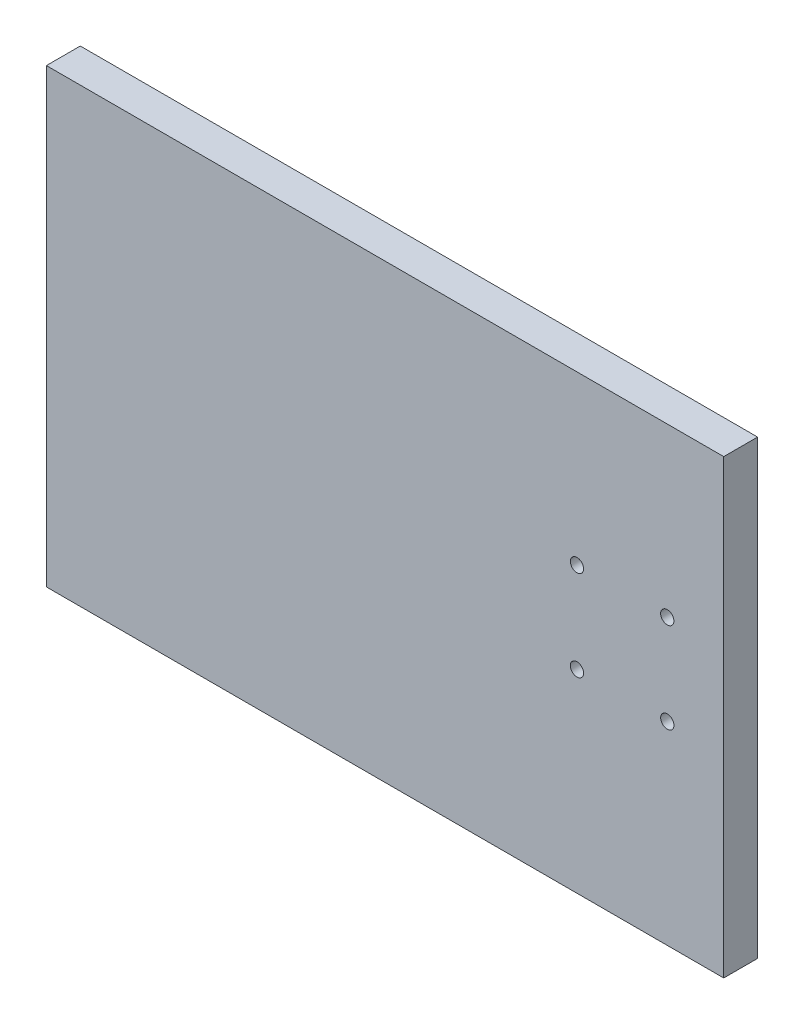
ISO-10303-21;
HEADER;
FILE_DESCRIPTION(('STEP AP214'),'2;1');
FILE_NAME('part.step','',(''),(''),'','','');
FILE_SCHEMA(('AUTOMOTIVE_DESIGN { 1 0 10303 214 1 1 1 1 }'));
ENDSEC;
DATA;
#1=APPLICATION_CONTEXT('core data for automotive mechanical design processes');
#2=APPLICATION_PROTOCOL_DEFINITION('international standard','automotive_design',2000,#1);
#3=PRODUCT_CONTEXT('',#1,'mechanical');
#4=PRODUCT('Part','Part','',(#3));
#5=PRODUCT_RELATED_PRODUCT_CATEGORY('part','',(#4));
#6=PRODUCT_DEFINITION_FORMATION('','',#4);
#7=PRODUCT_DEFINITION_CONTEXT('part definition',#1,'design');
#8=PRODUCT_DEFINITION('design','',#6,#7);
#9=PRODUCT_DEFINITION_SHAPE('','',#8);
#10=(LENGTH_UNIT() NAMED_UNIT(*) SI_UNIT(.MILLI.,.METRE.));
#11=(NAMED_UNIT(*) PLANE_ANGLE_UNIT() SI_UNIT($,.RADIAN.));
#12=(NAMED_UNIT(*) SI_UNIT($,.STERADIAN.) SOLID_ANGLE_UNIT());
#13=UNCERTAINTY_MEASURE_WITH_UNIT(LENGTH_MEASURE(1.E-05),#10,'distance_accuracy_value','');
#14=(GEOMETRIC_REPRESENTATION_CONTEXT(3) GLOBAL_UNCERTAINTY_ASSIGNED_CONTEXT((#13)) GLOBAL_UNIT_ASSIGNED_CONTEXT((#10,
#11,#12)) REPRESENTATION_CONTEXT('',''));
#15=CARTESIAN_POINT('',(0.,0.,0.));
#16=DIRECTION('',(0.,0.,1.));
#17=DIRECTION('',(1.,0.,0.));
#18=AXIS2_PLACEMENT_3D('',#15,#16,#17);
#19=CARTESIAN_POINT('',(-64.0158720642566,42.1858972249347,6.));
#20=DIRECTION('',(1.,0.,0.));
#21=DIRECTION('',(0.,0.,-1.));
#22=AXIS2_PLACEMENT_3D('',#19,#20,#21);
#23=PLANE('',#22);
#24=DIRECTION('',(0.,-1.,0.));
#25=VECTOR('',#24,1.);
#26=CARTESIAN_POINT('',(-64.0158720642566,42.1858972249347,0.));
#27=LINE('',#26,#25);
#28=CARTESIAN_POINT('',(-64.0158720642566,42.1858972249347,0.));
#29=VERTEX_POINT('',#28);
#30=CARTESIAN_POINT('',(-64.0158720642566,-37.8141027750654,0.));
#31=VERTEX_POINT('',#30);
#32=EDGE_CURVE('E96',#29,#31,#27,.T.);
#33=ORIENTED_EDGE('',*,*,#32,.T.);
#34=DIRECTION('',(0.,0.,-1.));
#35=VECTOR('',#34,1.);
#36=CARTESIAN_POINT('',(-64.0158720642566,-37.8141027750654,6.));
#37=LINE('',#36,#35);
#38=CARTESIAN_POINT('',(-64.0158720642566,-37.8141027750654,6.));
#39=VERTEX_POINT('',#38);
#40=EDGE_CURVE('E11',#39,#31,#37,.T.);
#41=ORIENTED_EDGE('',*,*,#40,.F.);
#42=DIRECTION('',(0.,-1.,0.));
#43=VECTOR('',#42,1.);
#44=CARTESIAN_POINT('',(-64.0158720642566,42.1858972249347,6.));
#45=LINE('',#44,#43);
#46=CARTESIAN_POINT('',(-64.0158720642566,42.1858972249347,6.));
#47=VERTEX_POINT('',#46);
#48=EDGE_CURVE('E84',#47,#39,#45,.T.);
#49=ORIENTED_EDGE('',*,*,#48,.F.);
#50=DIRECTION('',(0.,0.,-1.));
#51=VECTOR('',#50,1.);
#52=CARTESIAN_POINT('',(-64.0158720642566,42.1858972249347,6.));
#53=LINE('',#52,#51);
#54=EDGE_CURVE('E92',#47,#29,#53,.T.);
#55=ORIENTED_EDGE('',*,*,#54,.T.);
#56=EDGE_LOOP('',(#33,#41,#49,#55));
#57=FACE_BOUND('',#56,.T.);
#58=ADVANCED_FACE('F33',(#57),#23,.F.);
#59=CARTESIAN_POINT('',(-64.0158720642566,-37.8141027750654,6.));
#60=DIRECTION('',(0.,1.,0.));
#61=DIRECTION('',(-1.,0.,0.));
#62=AXIS2_PLACEMENT_3D('',#59,#60,#61);
#63=PLANE('',#62);
#64=DIRECTION('',(1.,0.,0.));
#65=VECTOR('',#64,1.);
#66=CARTESIAN_POINT('',(-64.0158720642566,-37.8141027750654,0.));
#67=LINE('',#66,#65);
#68=CARTESIAN_POINT('',(55.9841279357434,-37.8141027750653,0.));
#69=VERTEX_POINT('',#68);
#70=EDGE_CURVE('E88',#31,#69,#67,.T.);
#71=ORIENTED_EDGE('',*,*,#70,.T.);
#72=DIRECTION('',(0.,0.,-1.));
#73=VECTOR('',#72,1.);
#74=CARTESIAN_POINT('',(55.9841279357434,-37.8141027750653,6.));
#75=LINE('',#74,#73);
#76=CARTESIAN_POINT('',(55.9841279357434,-37.8141027750653,6.));
#77=VERTEX_POINT('',#76);
#78=EDGE_CURVE('E41',#77,#69,#75,.T.);
#79=ORIENTED_EDGE('',*,*,#78,.F.);
#80=DIRECTION('',(1.,0.,0.));
#81=VECTOR('',#80,1.);
#82=CARTESIAN_POINT('',(-64.0158720642566,-37.8141027750654,6.));
#83=LINE('',#82,#81);
#84=EDGE_CURVE('E79',#39,#77,#83,.T.);
#85=ORIENTED_EDGE('',*,*,#84,.F.);
#86=ORIENTED_EDGE('',*,*,#40,.T.);
#87=EDGE_LOOP('',(#71,#79,#85,#86));
#88=FACE_BOUND('',#87,.T.);
#89=ADVANCED_FACE('F87',(#88),#63,.F.);
#90=CARTESIAN_POINT('',(55.9841279357434,42.1858972249347,6.));
#91=DIRECTION('',(-1.,0.,0.));
#92=DIRECTION('',(0.,-1.,0.));
#93=AXIS2_PLACEMENT_3D('',#90,#91,#92);
#94=PLANE('',#93);
#95=DIRECTION('',(0.,1.,0.));
#96=VECTOR('',#95,1.);
#97=CARTESIAN_POINT('',(55.9841279357434,42.1858972249347,0.));
#98=LINE('',#97,#96);
#99=CARTESIAN_POINT('',(55.9841279357434,42.1858972249347,0.));
#100=VERTEX_POINT('',#99);
#101=EDGE_CURVE('E66',#69,#100,#98,.T.);
#102=ORIENTED_EDGE('',*,*,#101,.T.);
#103=DIRECTION('',(0.,0.,-1.));
#104=VECTOR('',#103,1.);
#105=CARTESIAN_POINT('',(55.9841279357434,42.1858972249347,6.));
#106=LINE('',#105,#104);
#107=CARTESIAN_POINT('',(55.9841279357434,42.1858972249347,6.));
#108=VERTEX_POINT('',#107);
#109=EDGE_CURVE('E89',#108,#100,#106,.T.);
#110=ORIENTED_EDGE('',*,*,#109,.F.);
#111=DIRECTION('',(0.,1.,0.));
#112=VECTOR('',#111,1.);
#113=CARTESIAN_POINT('',(55.9841279357434,42.1858972249347,6.));
#114=LINE('',#113,#112);
#115=EDGE_CURVE('E82',#77,#108,#114,.T.);
#116=ORIENTED_EDGE('',*,*,#115,.F.);
#117=ORIENTED_EDGE('',*,*,#78,.T.);
#118=EDGE_LOOP('',(#102,#110,#116,#117));
#119=FACE_BOUND('',#118,.T.);
#120=ADVANCED_FACE('F90',(#119),#94,.F.);
#121=CARTESIAN_POINT('',(-64.0158720642566,42.1858972249347,6.));
#122=DIRECTION('',(0.,-1.,0.));
#123=DIRECTION('',(0.,0.,-1.));
#124=AXIS2_PLACEMENT_3D('',#121,#122,#123);
#125=PLANE('',#124);
#126=DIRECTION('',(-1.,0.,0.));
#127=VECTOR('',#126,1.);
#128=CARTESIAN_POINT('',(-64.0158720642566,42.1858972249347,0.));
#129=LINE('',#128,#127);
#130=EDGE_CURVE('E72',#100,#29,#129,.T.);
#131=ORIENTED_EDGE('',*,*,#130,.T.);
#132=ORIENTED_EDGE('',*,*,#54,.F.);
#133=DIRECTION('',(-1.,0.,0.));
#134=VECTOR('',#133,1.);
#135=CARTESIAN_POINT('',(-64.0158720642566,42.1858972249347,6.));
#136=LINE('',#135,#134);
#137=EDGE_CURVE('E49',#108,#47,#136,.T.);
#138=ORIENTED_EDGE('',*,*,#137,.F.);
#139=ORIENTED_EDGE('',*,*,#109,.T.);
#140=EDGE_LOOP('',(#131,#132,#138,#139));
#141=FACE_BOUND('',#140,.T.);
#142=ADVANCED_FACE('F104',(#141),#125,.F.);
#143=CARTESIAN_POINT('',(0.,0.,6.));
#144=DIRECTION('',(0.,0.,1.));
#145=DIRECTION('',(1.,0.,0.));
#146=AXIS2_PLACEMENT_3D('',#143,#144,#145);
#147=PLANE('',#146);
#148=CARTESIAN_POINT('',(45.9841279357434,-3.46410277506529,6.));
#149=DIRECTION('',(0.,0.,1.));
#150=DIRECTION('',(1.,0.,0.));
#151=AXIS2_PLACEMENT_3D('',#148,#149,#150);
#152=CIRCLE('',#151,1.175);
#153=CARTESIAN_POINT('',(47.1591279357434,-3.46410277506529,6.));
#154=VERTEX_POINT('',#153);
#155=EDGE_CURVE('E128',#154,#154,#152,.T.);
#156=ORIENTED_EDGE('',*,*,#155,.F.);
#157=EDGE_LOOP('',(#156));
#158=FACE_BOUND('',#157,.T.);
#159=CARTESIAN_POINT('',(29.9841279357434,-3.46410277506529,6.));
#160=DIRECTION('',(0.,0.,1.));
#161=DIRECTION('',(1.,0.,0.));
#162=AXIS2_PLACEMENT_3D('',#159,#160,#161);
#163=CIRCLE('',#162,1.17499999999999);
#164=CARTESIAN_POINT('',(31.1591279357434,-3.46410277506529,6.));
#165=VERTEX_POINT('',#164);
#166=EDGE_CURVE('E122',#165,#165,#163,.T.);
#167=ORIENTED_EDGE('',*,*,#166,.F.);
#168=EDGE_LOOP('',(#167));
#169=FACE_BOUND('',#168,.T.);
#170=CARTESIAN_POINT('',(29.9841279357434,12.5358972249347,6.));
#171=DIRECTION('',(0.,0.,1.));
#172=DIRECTION('',(1.,0.,0.));
#173=AXIS2_PLACEMENT_3D('',#170,#171,#172);
#174=CIRCLE('',#173,1.17499999999999);
#175=CARTESIAN_POINT('',(31.1591279357434,12.5358972249347,6.));
#176=VERTEX_POINT('',#175);
#177=EDGE_CURVE('E116',#176,#176,#174,.T.);
#178=ORIENTED_EDGE('',*,*,#177,.F.);
#179=EDGE_LOOP('',(#178));
#180=FACE_BOUND('',#179,.T.);
#181=CARTESIAN_POINT('',(45.9841279357434,12.5358972249347,6.));
#182=DIRECTION('',(0.,0.,1.));
#183=DIRECTION('',(1.,0.,0.));
#184=AXIS2_PLACEMENT_3D('',#181,#182,#183);
#185=CIRCLE('',#184,1.175);
#186=CARTESIAN_POINT('',(47.1591279357434,12.5358972249347,6.));
#187=VERTEX_POINT('',#186);
#188=EDGE_CURVE('E110',#187,#187,#185,.T.);
#189=ORIENTED_EDGE('',*,*,#188,.F.);
#190=EDGE_LOOP('',(#189));
#191=FACE_BOUND('',#190,.T.);
#192=ORIENTED_EDGE('',*,*,#48,.T.);
#193=ORIENTED_EDGE('',*,*,#84,.T.);
#194=ORIENTED_EDGE('',*,*,#115,.T.);
#195=ORIENTED_EDGE('',*,*,#137,.T.);
#196=EDGE_LOOP('',(#192,#193,#194,#195));
#197=FACE_BOUND('',#196,.T.);
#198=ADVANCED_FACE('F80',(#158,#169,#180,#191,#197),#147,.T.);
#199=CARTESIAN_POINT('',(0.,0.,0.));
#200=DIRECTION('',(0.,0.,1.));
#201=DIRECTION('',(1.,0.,0.));
#202=AXIS2_PLACEMENT_3D('',#199,#200,#201);
#203=PLANE('',#202);
#204=CARTESIAN_POINT('',(45.9841279357434,-3.46410277506529,0.));
#205=DIRECTION('',(0.,0.,1.));
#206=DIRECTION('',(1.,0.,0.));
#207=AXIS2_PLACEMENT_3D('',#204,#205,#206);
#208=CIRCLE('',#207,1.175);
#209=CARTESIAN_POINT('',(47.1591279357434,-3.46410277506529,0.));
#210=VERTEX_POINT('',#209);
#211=EDGE_CURVE('E125',#210,#210,#208,.T.);
#212=ORIENTED_EDGE('',*,*,#211,.T.);
#213=EDGE_LOOP('',(#212));
#214=FACE_BOUND('',#213,.T.);
#215=CARTESIAN_POINT('',(29.9841279357434,-3.46410277506529,0.));
#216=DIRECTION('',(0.,0.,1.));
#217=DIRECTION('',(1.,0.,0.));
#218=AXIS2_PLACEMENT_3D('',#215,#216,#217);
#219=CIRCLE('',#218,1.17499999999999);
#220=CARTESIAN_POINT('',(31.1591279357434,-3.46410277506529,0.));
#221=VERTEX_POINT('',#220);
#222=EDGE_CURVE('E119',#221,#221,#219,.T.);
#223=ORIENTED_EDGE('',*,*,#222,.T.);
#224=EDGE_LOOP('',(#223));
#225=FACE_BOUND('',#224,.T.);
#226=CARTESIAN_POINT('',(29.9841279357434,12.5358972249347,0.));
#227=DIRECTION('',(0.,0.,1.));
#228=DIRECTION('',(1.,0.,0.));
#229=AXIS2_PLACEMENT_3D('',#226,#227,#228);
#230=CIRCLE('',#229,1.17499999999999);
#231=CARTESIAN_POINT('',(31.1591279357434,12.5358972249347,0.));
#232=VERTEX_POINT('',#231);
#233=EDGE_CURVE('E113',#232,#232,#230,.T.);
#234=ORIENTED_EDGE('',*,*,#233,.T.);
#235=EDGE_LOOP('',(#234));
#236=FACE_BOUND('',#235,.T.);
#237=CARTESIAN_POINT('',(45.9841279357434,12.5358972249347,0.));
#238=DIRECTION('',(0.,0.,1.));
#239=DIRECTION('',(1.,0.,0.));
#240=AXIS2_PLACEMENT_3D('',#237,#238,#239);
#241=CIRCLE('',#240,1.175);
#242=CARTESIAN_POINT('',(47.1591279357434,12.5358972249347,0.));
#243=VERTEX_POINT('',#242);
#244=EDGE_CURVE('E99',#243,#243,#241,.T.);
#245=ORIENTED_EDGE('',*,*,#244,.T.);
#246=EDGE_LOOP('',(#245));
#247=FACE_BOUND('',#246,.T.);
#248=ORIENTED_EDGE('',*,*,#32,.F.);
#249=ORIENTED_EDGE('',*,*,#130,.F.);
#250=ORIENTED_EDGE('',*,*,#101,.F.);
#251=ORIENTED_EDGE('',*,*,#70,.F.);
#252=EDGE_LOOP('',(#248,#249,#250,#251));
#253=FACE_BOUND('',#252,.T.);
#254=ADVANCED_FACE('F107',(#214,#225,#236,#247,#253),#203,.F.);
#255=CARTESIAN_POINT('',(45.9841279357434,12.5358972249347,0.));
#256=DIRECTION('',(0.,0.,1.));
#257=DIRECTION('',(1.,0.,0.));
#258=AXIS2_PLACEMENT_3D('',#255,#256,#257);
#259=CYLINDRICAL_SURFACE('',#258,1.175);
#260=ORIENTED_EDGE('',*,*,#244,.F.);
#261=EDGE_LOOP('',(#260));
#262=FACE_BOUND('',#261,.T.);
#263=ORIENTED_EDGE('',*,*,#188,.T.);
#264=EDGE_LOOP('',(#263));
#265=FACE_BOUND('',#264,.T.);
#266=ADVANCED_FACE('F152',(#262,#265),#259,.F.);
#267=CARTESIAN_POINT('',(29.9841279357434,12.5358972249347,0.));
#268=DIRECTION('',(0.,0.,1.));
#269=DIRECTION('',(1.,0.,0.));
#270=AXIS2_PLACEMENT_3D('',#267,#268,#269);
#271=CYLINDRICAL_SURFACE('',#270,1.17499999999999);
#272=ORIENTED_EDGE('',*,*,#233,.F.);
#273=EDGE_LOOP('',(#272));
#274=FACE_BOUND('',#273,.T.);
#275=ORIENTED_EDGE('',*,*,#177,.T.);
#276=EDGE_LOOP('',(#275));
#277=FACE_BOUND('',#276,.T.);
#278=ADVANCED_FACE('F154',(#274,#277),#271,.F.);
#279=CARTESIAN_POINT('',(29.9841279357434,-3.46410277506529,0.));
#280=DIRECTION('',(0.,0.,1.));
#281=DIRECTION('',(1.,0.,0.));
#282=AXIS2_PLACEMENT_3D('',#279,#280,#281);
#283=CYLINDRICAL_SURFACE('',#282,1.17499999999999);
#284=ORIENTED_EDGE('',*,*,#222,.F.);
#285=EDGE_LOOP('',(#284));
#286=FACE_BOUND('',#285,.T.);
#287=ORIENTED_EDGE('',*,*,#166,.T.);
#288=EDGE_LOOP('',(#287));
#289=FACE_BOUND('',#288,.T.);
#290=ADVANCED_FACE('F139',(#286,#289),#283,.F.);
#291=CARTESIAN_POINT('',(45.9841279357434,-3.46410277506529,0.));
#292=DIRECTION('',(0.,0.,1.));
#293=DIRECTION('',(1.,0.,0.));
#294=AXIS2_PLACEMENT_3D('',#291,#292,#293);
#295=CYLINDRICAL_SURFACE('',#294,1.175);
#296=ORIENTED_EDGE('',*,*,#211,.F.);
#297=EDGE_LOOP('',(#296));
#298=FACE_BOUND('',#297,.T.);
#299=ORIENTED_EDGE('',*,*,#155,.T.);
#300=EDGE_LOOP('',(#299));
#301=FACE_BOUND('',#300,.T.);
#302=ADVANCED_FACE('F136',(#298,#301),#295,.F.);
#303=CLOSED_SHELL('',(#58,#89,#120,#142,#198,#254,#266,#278,#290,#302));
#304=MANIFOLD_SOLID_BREP('B2',#303);
#305=ADVANCED_BREP_SHAPE_REPRESENTATION('',(#18,#304),#14);
#306=SHAPE_DEFINITION_REPRESENTATION(#9,#305);
ENDSEC;
END-ISO-10303-21;
